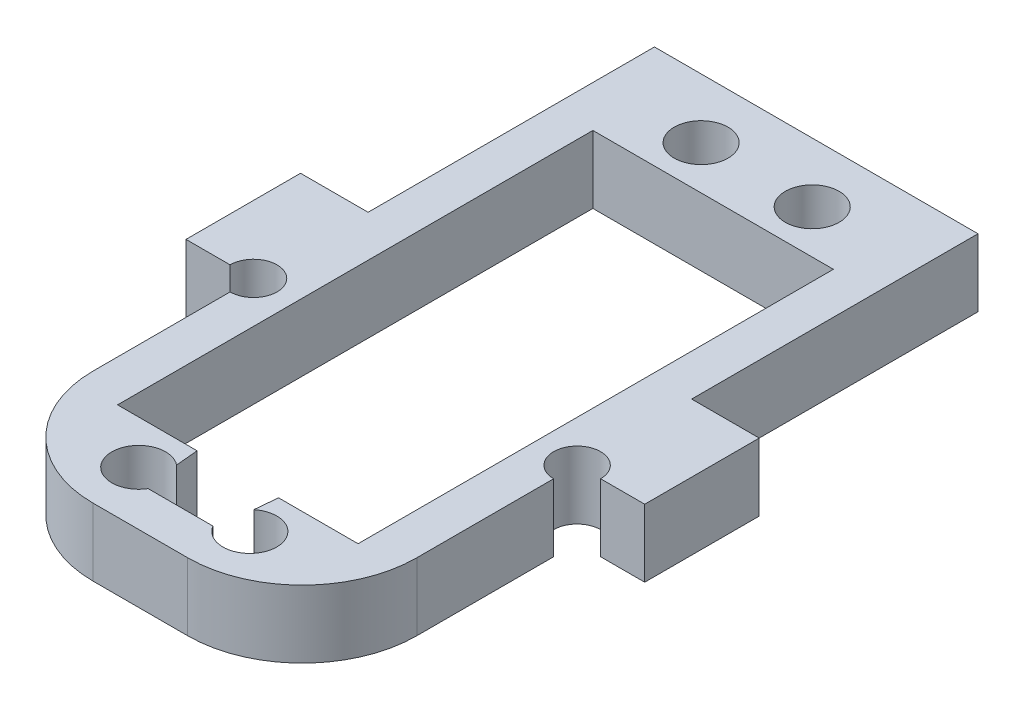
ISO-10303-21;
HEADER;
FILE_DESCRIPTION(('STEP AP214'),'2;1');
FILE_NAME('part.step','',(''),(''),'','','');
FILE_SCHEMA(('AUTOMOTIVE_DESIGN { 1 0 10303 214 1 1 1 1 }'));
ENDSEC;
DATA;
#1=APPLICATION_CONTEXT('core data for automotive mechanical design processes');
#2=APPLICATION_PROTOCOL_DEFINITION('international standard','automotive_design',2000,#1);
#3=PRODUCT_CONTEXT('',#1,'mechanical');
#4=PRODUCT('Part','Part','',(#3));
#5=PRODUCT_RELATED_PRODUCT_CATEGORY('part','',(#4));
#6=PRODUCT_DEFINITION_FORMATION('','',#4);
#7=PRODUCT_DEFINITION_CONTEXT('part definition',#1,'design');
#8=PRODUCT_DEFINITION('design','',#6,#7);
#9=PRODUCT_DEFINITION_SHAPE('','',#8);
#10=(LENGTH_UNIT() NAMED_UNIT(*) SI_UNIT(.MILLI.,.METRE.));
#11=(NAMED_UNIT(*) PLANE_ANGLE_UNIT() SI_UNIT($,.RADIAN.));
#12=(NAMED_UNIT(*) SI_UNIT($,.STERADIAN.) SOLID_ANGLE_UNIT());
#13=UNCERTAINTY_MEASURE_WITH_UNIT(LENGTH_MEASURE(1.E-05),#10,'distance_accuracy_value','');
#14=(GEOMETRIC_REPRESENTATION_CONTEXT(3) GLOBAL_UNCERTAINTY_ASSIGNED_CONTEXT((#13)) GLOBAL_UNIT_ASSIGNED_CONTEXT((#10,
#11,#12)) REPRESENTATION_CONTEXT('',''));
#15=CARTESIAN_POINT('',(0.,0.,0.));
#16=DIRECTION('',(0.,0.,1.));
#17=DIRECTION('',(1.,0.,0.));
#18=AXIS2_PLACEMENT_3D('',#15,#16,#17);
#19=CARTESIAN_POINT('',(14.1249999999984,5.89999999999827,27.9999999999989));
#20=DIRECTION('',(-0.999999999999975,0.,0.));
#21=DIRECTION('',(0.,0.,0.999999999999964));
#22=AXIS2_PLACEMENT_3D('',#19,#20,#21);
#23=PLANE('',#22);
#24=DIRECTION('',(0.,0.99999999999999,0.));
#25=VECTOR('',#24,1.);
#26=CARTESIAN_POINT('',(14.1249999999982,-11.6107708615777,-4.99999999999945));
#27=LINE('',#26,#25);
#28=CARTESIAN_POINT('',(14.1249999999985,0.,-4.99999999999894));
#29=VERTEX_POINT('',#28);
#30=CARTESIAN_POINT('',(14.1249999999985,5.8999999999978,-4.99999999999981));
#31=VERTEX_POINT('',#30);
#32=EDGE_CURVE('E252',#29,#31,#27,.T.);
#33=ORIENTED_EDGE('',*,*,#32,.F.);
#34=DIRECTION('',(0.,0.,-0.999999999999964));
#35=VECTOR('',#34,1.);
#36=CARTESIAN_POINT('',(14.1249999999984,0.,28.));
#37=LINE('',#36,#35);
#38=CARTESIAN_POINT('',(14.1249999999985,-2.16493489801906E-12,-29.9999999999992));
#39=VERTEX_POINT('',#38);
#40=EDGE_CURVE('E310',#29,#39,#37,.T.);
#41=ORIENTED_EDGE('',*,*,#40,.T.);
#42=DIRECTION('',(0.,-0.99999999999999,0.));
#43=VECTOR('',#42,1.);
#44=CARTESIAN_POINT('',(14.1249999999985,5.89999999999752,-29.999999999999));
#45=LINE('',#44,#43);
#46=CARTESIAN_POINT('',(14.1249999999985,5.89999999999752,-29.999999999999));
#47=VERTEX_POINT('',#46);
#48=EDGE_CURVE('E351',#47,#39,#45,.T.);
#49=ORIENTED_EDGE('',*,*,#48,.F.);
#50=DIRECTION('',(0.,0.,-0.999999999999964));
#51=VECTOR('',#50,1.);
#52=CARTESIAN_POINT('',(14.1249999999984,5.89999999999827,27.9999999999989));
#53=LINE('',#52,#51);
#54=EDGE_CURVE('E334',#31,#47,#53,.T.);
#55=ORIENTED_EDGE('',*,*,#54,.F.);
#56=EDGE_LOOP('',(#33,#41,#49,#55));
#57=FACE_BOUND('',#56,.T.);
#58=ADVANCED_FACE('F36',(#57),#23,.F.);
#59=CARTESIAN_POINT('',(-14.1250000000017,5.89999999999727,27.9999999999992));
#60=DIRECTION('',(0.999999999999975,0.,0.));
#61=DIRECTION('',(0.,0.,-0.999999999999964));
#62=AXIS2_PLACEMENT_3D('',#59,#60,#61);
#63=PLANE('',#62);
#64=DIRECTION('',(0.,0.,0.999999999999964));
#65=VECTOR('',#64,1.);
#66=CARTESIAN_POINT('',(-14.1250000000015,-1.02695629777827E-12,27.9999999999998));
#67=LINE('',#66,#65);
#68=CARTESIAN_POINT('',(-14.1250000000017,0.,7.04999999999949));
#69=VERTEX_POINT('',#68);
#70=CARTESIAN_POINT('',(-14.1250000000002,0.,18.9999999999995));
#71=VERTEX_POINT('',#70);
#72=EDGE_CURVE('E345',#69,#71,#67,.T.);
#73=ORIENTED_EDGE('',*,*,#72,.T.);
#74=DIRECTION('',(0.,-0.99999999999999,0.));
#75=VECTOR('',#74,1.);
#76=CARTESIAN_POINT('',(-14.1250000000003,5.89999999999896,18.9999999999998));
#77=LINE('',#76,#75);
#78=CARTESIAN_POINT('',(-14.1250000000003,5.89999999999896,18.9999999999998));
#79=VERTEX_POINT('',#78);
#80=EDGE_CURVE('E11',#71,#79,#77,.F.);
#81=ORIENTED_EDGE('',*,*,#80,.T.);
#82=DIRECTION('',(0.,0.,0.999999999999964));
#83=VECTOR('',#82,1.);
#84=CARTESIAN_POINT('',(-14.1250000000017,5.89999999999727,27.9999999999992));
#85=LINE('',#84,#83);
#86=CARTESIAN_POINT('',(-14.125,5.89999999999716,7.05000000000063));
#87=VERTEX_POINT('',#86);
#88=EDGE_CURVE('E336',#87,#79,#85,.T.);
#89=ORIENTED_EDGE('',*,*,#88,.F.);
#90=DIRECTION('',(0.,0.99999999999999,0.));
#91=VECTOR('',#90,1.);
#92=CARTESIAN_POINT('',(-14.1250000000017,-0.00100000000102796,7.04999999999989));
#93=LINE('',#92,#91);
#94=EDGE_CURVE('E245',#69,#87,#93,.T.);
#95=ORIENTED_EDGE('',*,*,#94,.F.);
#96=EDGE_LOOP('',(#73,#81,#89,#95));
#97=FACE_BOUND('',#96,.T.);
#98=ADVANCED_FACE('F444',(#97),#63,.F.);
#99=CARTESIAN_POINT('',(14.1249999999985,5.89999999999896,18.9999999999998));
#100=VERTEX_POINT('',#99);
#101=CARTESIAN_POINT('',(14.1249999999982,5.89999999999882,7.04999999999996));
#102=VERTEX_POINT('',#101);
#103=EDGE_CURVE('E331',#100,#102,#53,.T.);
#104=ORIENTED_EDGE('',*,*,#103,.F.);
#105=DIRECTION('',(0.,0.99999999999999,0.));
#106=VECTOR('',#105,1.);
#107=CARTESIAN_POINT('',(14.1249999999982,-7.49400541621981E-13,18.9999999999987));
#108=LINE('',#107,#106);
#109=CARTESIAN_POINT('',(14.1249999999982,-7.49400541621981E-13,18.9999999999987));
#110=VERTEX_POINT('',#109);
#111=EDGE_CURVE('E371',#100,#110,#108,.F.);
#112=ORIENTED_EDGE('',*,*,#111,.T.);
#113=CARTESIAN_POINT('',(14.1249999999984,-2.16493489801906E-12,7.04999999999983));
#114=VERTEX_POINT('',#113);
#115=EDGE_CURVE('E341',#110,#114,#37,.T.);
#116=ORIENTED_EDGE('',*,*,#115,.T.);
#117=DIRECTION('',(0.,0.99999999999999,0.));
#118=VECTOR('',#117,1.);
#119=CARTESIAN_POINT('',(14.1249999999984,-0.00100000000133327,7.04999999999986));
#120=LINE('',#119,#118);
#121=EDGE_CURVE('E256',#102,#114,#120,.F.);
#122=ORIENTED_EDGE('',*,*,#121,.F.);
#123=EDGE_LOOP('',(#104,#112,#116,#122));
#124=FACE_BOUND('',#123,.T.);
#125=ADVANCED_FACE('F396',(#124),#23,.F.);
#126=CARTESIAN_POINT('',(-14.125,5.89999999999705,-29.999999999999));
#127=DIRECTION('',(0.,0.,0.999999999999964));
#128=DIRECTION('',(0.999999999999975,0.,0.));
#129=AXIS2_PLACEMENT_3D('',#126,#127,#128);
#130=PLANE('',#129);
#131=DIRECTION('',(-0.999999999999975,0.,0.));
#132=VECTOR('',#131,1.);
#133=CARTESIAN_POINT('',(-14.1250000000002,-2.05391259555654E-12,-29.999999999999));
#134=LINE('',#133,#132);
#135=CARTESIAN_POINT('',(-14.1250000000002,-2.05391259555654E-12,-29.999999999999));
#136=VERTEX_POINT('',#135);
#137=EDGE_CURVE('E343',#39,#136,#134,.T.);
#138=ORIENTED_EDGE('',*,*,#137,.T.);
#139=DIRECTION('',(0.,-0.99999999999999,0.));
#140=VECTOR('',#139,1.);
#141=CARTESIAN_POINT('',(-14.125,5.89999999999705,-29.999999999999));
#142=LINE('',#141,#140);
#143=CARTESIAN_POINT('',(-14.125,5.89999999999705,-29.999999999999));
#144=VERTEX_POINT('',#143);
#145=EDGE_CURVE('E340',#144,#136,#142,.T.);
#146=ORIENTED_EDGE('',*,*,#145,.F.);
#147=DIRECTION('',(-0.999999999999975,0.,0.));
#148=VECTOR('',#147,1.);
#149=CARTESIAN_POINT('',(-14.125,5.89999999999705,-29.999999999999));
#150=LINE('',#149,#148);
#151=EDGE_CURVE('E333',#47,#144,#150,.T.);
#152=ORIENTED_EDGE('',*,*,#151,.F.);
#153=ORIENTED_EDGE('',*,*,#48,.T.);
#154=EDGE_LOOP('',(#138,#146,#152,#153));
#155=FACE_BOUND('',#154,.T.);
#156=ADVANCED_FACE('F421',(#155),#130,.F.);
#157=CARTESIAN_POINT('',(-14.1250000000015,0.,-4.99999999999994));
#158=VERTEX_POINT('',#157);
#159=EDGE_CURVE('E346',#136,#158,#67,.T.);
#160=ORIENTED_EDGE('',*,*,#159,.T.);
#161=DIRECTION('',(0.,0.99999999999999,0.));
#162=VECTOR('',#161,1.);
#163=CARTESIAN_POINT('',(-14.1250000000018,-11.6107708615767,-4.99999999999905));
#164=LINE('',#163,#162);
#165=CARTESIAN_POINT('',(-14.1250000000002,5.89999999999793,-4.9999999999996));
#166=VERTEX_POINT('',#165);
#167=EDGE_CURVE('E294',#158,#166,#164,.T.);
#168=ORIENTED_EDGE('',*,*,#167,.T.);
#169=EDGE_CURVE('E337',#144,#166,#85,.T.);
#170=ORIENTED_EDGE('',*,*,#169,.F.);
#171=ORIENTED_EDGE('',*,*,#145,.T.);
#172=EDGE_LOOP('',(#160,#168,#170,#171));
#173=FACE_BOUND('',#172,.T.);
#174=ADVANCED_FACE('F424',(#173),#63,.F.);
#175=CARTESIAN_POINT('',(-1.5404344466674E-12,5.89999999999899,-3.33066907387547E-13));
#176=DIRECTION('',(0.,-0.99999999999999,0.));
#177=DIRECTION('',(0.,0.,-0.999999999999964));
#178=AXIS2_PLACEMENT_3D('',#175,#176,#177);
#179=PLANE('',#178);
#180=DIRECTION('',(0.,0.,-0.999999999999964));
#181=VECTOR('',#180,1.);
#182=CARTESIAN_POINT('',(10.4999999999982,5.89999999999796,20.4999999999979));
#183=LINE('',#182,#181);
#184=CARTESIAN_POINT('',(10.4999999999982,5.89999999999796,20.4999999999979));
#185=VERTEX_POINT('',#184);
#186=CARTESIAN_POINT('',(10.4999999999982,5.89999999999496,-20.9999999999992));
#187=VERTEX_POINT('',#186);
#188=EDGE_CURVE('E482',#185,#187,#183,.T.);
#189=ORIENTED_EDGE('',*,*,#188,.F.);
#190=DIRECTION('',(0.999999999999975,0.,0.));
#191=VECTOR('',#190,1.);
#192=CARTESIAN_POINT('',(-10.5000000000018,5.89999999999791,20.4999999999998));
#193=LINE('',#192,#191);
#194=CARTESIAN_POINT('',(3.55454545454366,5.89999999999932,20.4999999999981));
#195=VERTEX_POINT('',#194);
#196=EDGE_CURVE('E479',#195,#185,#193,.T.);
#197=ORIENTED_EDGE('',*,*,#196,.F.);
#198=DIRECTION('',(0.0905357460425185,0.,-0.99589320646767));
#199=VECTOR('',#198,1.);
#200=CARTESIAN_POINT('',(3.59999999999847,5.89999999999793,19.9999999999999));
#201=LINE('',#200,#199);
#202=CARTESIAN_POINT('',(3.3754362039405,5.89999999999899,22.4702017566538));
#203=VERTEX_POINT('',#202);
#204=EDGE_CURVE('E454',#203,#195,#201,.T.);
#205=ORIENTED_EDGE('',*,*,#204,.F.);
#206=CARTESIAN_POINT('',(4.84999999999847,5.89999999999691,24.2999999999992));
#207=DIRECTION('',(0.,0.99999999999999,0.));
#208=DIRECTION('',(0.,0.,-0.999999999999964));
#209=AXIS2_PLACEMENT_3D('',#206,#207,#208);
#210=CIRCLE('',#209,2.35);
#211=CARTESIAN_POINT('',(2.82948026488232,5.89999999999832,25.4999999999981));
#212=VERTEX_POINT('',#211);
#213=EDGE_CURVE('E307',#212,#203,#210,.T.);
#214=ORIENTED_EDGE('',*,*,#213,.F.);
#215=DIRECTION('',(0.999999999999975,0.,0.));
#216=VECTOR('',#215,1.);
#217=CARTESIAN_POINT('',(-3.10000000000013,5.89999999999841,25.4999999999996));
#218=LINE('',#217,#216);
#219=CARTESIAN_POINT('',(-2.82948026488244,5.89999999999793,25.4999999999999));
#220=VERTEX_POINT('',#219);
#221=EDGE_CURVE('E449',#220,#212,#218,.T.);
#222=ORIENTED_EDGE('',*,*,#221,.F.);
#223=CARTESIAN_POINT('',(-4.85000000000167,5.89999999999718,24.2999999999987));
#224=DIRECTION('',(0.,0.99999999999999,0.));
#225=DIRECTION('',(0.,0.,0.999999999999964));
#226=AXIS2_PLACEMENT_3D('',#223,#224,#225);
#227=CIRCLE('',#226,2.35);
#228=CARTESIAN_POINT('',(-3.37543620394062,5.89999999999896,22.470201756654));
#229=VERTEX_POINT('',#228);
#230=EDGE_CURVE('E311',#229,#220,#227,.T.);
#231=ORIENTED_EDGE('',*,*,#230,.F.);
#232=DIRECTION('',(0.0905357460425095,0.,0.995893206467665));
#233=VECTOR('',#232,1.);
#234=CARTESIAN_POINT('',(-3.60000000000164,5.89999999999388,20.));
#235=LINE('',#234,#233);
#236=CARTESIAN_POINT('',(-3.5545454545471,5.89999999999627,20.4999999999991));
#237=VERTEX_POINT('',#236);
#238=EDGE_CURVE('E447',#237,#229,#235,.T.);
#239=ORIENTED_EDGE('',*,*,#238,.F.);
#240=CARTESIAN_POINT('',(-10.5000000000018,5.89999999999791,20.4999999999998));
#241=VERTEX_POINT('',#240);
#242=EDGE_CURVE('E51',#241,#237,#193,.T.);
#243=ORIENTED_EDGE('',*,*,#242,.F.);
#244=DIRECTION('',(0.,0.,0.999999999999964));
#245=VECTOR('',#244,1.);
#246=CARTESIAN_POINT('',(-10.5000000000018,5.89999999999791,20.4999999999998));
#247=LINE('',#246,#245);
#248=CARTESIAN_POINT('',(-10.5000000000018,5.89999999999558,-20.9999999999992));
#249=VERTEX_POINT('',#248);
#250=EDGE_CURVE('E485',#249,#241,#247,.T.);
#251=ORIENTED_EDGE('',*,*,#250,.F.);
#252=DIRECTION('',(-0.999999999999975,0.,0.));
#253=VECTOR('',#252,1.);
#254=CARTESIAN_POINT('',(-10.5000000000018,5.89999999999558,-20.9999999999992));
#255=LINE('',#254,#253);
#256=EDGE_CURVE('E489',#187,#249,#255,.T.);
#257=ORIENTED_EDGE('',*,*,#256,.F.);
#258=EDGE_LOOP('',(#189,#197,#205,#214,#222,#231,#239,#243,#251,#257));
#259=FACE_BOUND('',#258,.T.);
#260=CARTESIAN_POINT('',(4.84999999999847,5.89999999999646,-24.7999999999993));
#261=DIRECTION('',(0.,0.99999999999999,0.));
#262=DIRECTION('',(0.,0.,0.999999999999964));
#263=AXIS2_PLACEMENT_3D('',#260,#261,#262);
#264=CIRCLE('',#263,2.35);
#265=CARTESIAN_POINT('',(4.84999999999846,5.89999999999648,-22.4499999999994));
#266=VERTEX_POINT('',#265);
#267=EDGE_CURVE('E323',#266,#266,#264,.T.);
#268=ORIENTED_EDGE('',*,*,#267,.F.);
#269=EDGE_LOOP('',(#268));
#270=FACE_BOUND('',#269,.T.);
#271=CARTESIAN_POINT('',(-4.85000000000155,5.89999999999688,-24.7999999999999));
#272=DIRECTION('',(0.,0.99999999999999,0.));
#273=DIRECTION('',(0.,0.,-0.999999999999964));
#274=AXIS2_PLACEMENT_3D('',#271,#272,#273);
#275=CIRCLE('',#274,2.35);
#276=CARTESIAN_POINT('',(-4.85000000000154,5.89999999999686,-27.1499999999998));
#277=VERTEX_POINT('',#276);
#278=EDGE_CURVE('E317',#277,#277,#275,.T.);
#279=ORIENTED_EDGE('',*,*,#278,.F.);
#280=EDGE_LOOP('',(#279));
#281=FACE_BOUND('',#280,.T.);
#282=DIRECTION('',(-0.999999999999975,0.,0.));
#283=VECTOR('',#282,1.);
#284=CARTESIAN_POINT('',(14.1249999999982,5.89999999999946,28.9999999999986));
#285=LINE('',#284,#283);
#286=CARTESIAN_POINT('',(4.1249999999982,5.89999999999768,28.9999999999984));
#287=VERTEX_POINT('',#286);
#288=CARTESIAN_POINT('',(-4.12500000000154,5.89999999999696,28.9999999999984));
#289=VERTEX_POINT('',#288);
#290=EDGE_CURVE('E386',#287,#289,#285,.T.);
#291=ORIENTED_EDGE('',*,*,#290,.F.);
#292=CARTESIAN_POINT('',(4.12499999999846,5.89999999999696,18.9999999999993));
#293=DIRECTION('',(0.,-0.99999999999999,0.));
#294=DIRECTION('',(0.,0.,-0.999999999999964));
#295=AXIS2_PLACEMENT_3D('',#292,#293,#294);
#296=CIRCLE('',#295,10.);
#297=EDGE_CURVE('E369',#287,#100,#296,.F.);
#298=ORIENTED_EDGE('',*,*,#297,.T.);
#299=ORIENTED_EDGE('',*,*,#103,.T.);
#300=CARTESIAN_POINT('',(14.125,5.90000000000071,5.00000000000007));
#301=DIRECTION('',(0.,0.99999999999999,0.));
#302=DIRECTION('',(0.,0.,0.999999999999964));
#303=AXIS2_PLACEMENT_3D('',#300,#301,#302);
#304=CIRCLE('',#303,2.05);
#305=CARTESIAN_POINT('',(16.175,5.89999999999793,4.99999999999963));
#306=VERTEX_POINT('',#305);
#307=EDGE_CURVE('E236',#306,#102,#304,.T.);
#308=ORIENTED_EDGE('',*,*,#307,.F.);
#309=DIRECTION('',(0.999999999999975,0.,0.));
#310=VECTOR('',#309,1.);
#311=CARTESIAN_POINT('',(14.125,5.90000000000071,5.00000000000007));
#312=LINE('',#311,#310);
#313=CARTESIAN_POINT('',(20.0249999999977,5.89999999999793,4.9999999999995));
#314=VERTEX_POINT('',#313);
#315=EDGE_CURVE('E275',#306,#314,#312,.T.);
#316=ORIENTED_EDGE('',*,*,#315,.T.);
#317=DIRECTION('',(0.,0.,-0.999999999999964));
#318=VECTOR('',#317,1.);
#319=CARTESIAN_POINT('',(20.0249999999977,5.89999999999988,-5.00000000000111));
#320=LINE('',#319,#318);
#321=CARTESIAN_POINT('',(20.0249999999977,5.89999999999988,-5.00000000000111));
#322=VERTEX_POINT('',#321);
#323=EDGE_CURVE('E278',#314,#322,#320,.T.);
#324=ORIENTED_EDGE('',*,*,#323,.T.);
#325=DIRECTION('',(-0.999999999999975,0.,0.));
#326=VECTOR('',#325,1.);
#327=CARTESIAN_POINT('',(14.1249999999985,5.8999999999978,-4.99999999999981));
#328=LINE('',#327,#326);
#329=EDGE_CURVE('E274',#322,#31,#328,.T.);
#330=ORIENTED_EDGE('',*,*,#329,.T.);
#331=ORIENTED_EDGE('',*,*,#54,.T.);
#332=ORIENTED_EDGE('',*,*,#151,.T.);
#333=ORIENTED_EDGE('',*,*,#169,.T.);
#334=DIRECTION('',(-0.999999999999975,0.,0.));
#335=VECTOR('',#334,1.);
#336=CARTESIAN_POINT('',(-14.1250000000002,5.89999999999793,-4.9999999999996));
#337=LINE('',#336,#335);
#338=CARTESIAN_POINT('',(-20.025,5.89999999999999,-5.00000000000039));
#339=VERTEX_POINT('',#338);
#340=EDGE_CURVE('E283',#166,#339,#337,.T.);
#341=ORIENTED_EDGE('',*,*,#340,.T.);
#342=DIRECTION('',(0.,0.,0.999999999999964));
#343=VECTOR('',#342,1.);
#344=CARTESIAN_POINT('',(-20.025,5.89999999999999,-5.00000000000039));
#345=LINE('',#344,#343);
#346=CARTESIAN_POINT('',(-20.0250000000001,5.89999999999793,4.9999999999998));
#347=VERTEX_POINT('',#346);
#348=EDGE_CURVE('E277',#339,#347,#345,.T.);
#349=ORIENTED_EDGE('',*,*,#348,.T.);
#350=DIRECTION('',(0.999999999999975,0.,0.));
#351=VECTOR('',#350,1.);
#352=CARTESIAN_POINT('',(-14.1250000000001,5.89999999999874,5.00000000000089));
#353=LINE('',#352,#351);
#354=CARTESIAN_POINT('',(-16.1750000000001,5.89999999999782,4.99999999999978));
#355=VERTEX_POINT('',#354);
#356=EDGE_CURVE('E287',#347,#355,#353,.T.);
#357=ORIENTED_EDGE('',*,*,#356,.T.);
#358=CARTESIAN_POINT('',(-14.1250000000001,5.89999999999874,5.00000000000089));
#359=DIRECTION('',(0.,0.99999999999999,0.));
#360=DIRECTION('',(0.,0.,0.999999999999964));
#361=AXIS2_PLACEMENT_3D('',#358,#359,#360);
#362=CIRCLE('',#361,2.05);
#363=EDGE_CURVE('E248',#87,#355,#362,.T.);
#364=ORIENTED_EDGE('',*,*,#363,.F.);
#365=ORIENTED_EDGE('',*,*,#88,.T.);
#366=CARTESIAN_POINT('',(-4.12500000000017,5.89999999999596,18.9999999999993));
#367=DIRECTION('',(0.,-0.99999999999999,0.));
#368=DIRECTION('',(0.,0.,-0.999999999999964));
#369=AXIS2_PLACEMENT_3D('',#366,#367,#368);
#370=CIRCLE('',#369,10.);
#371=EDGE_CURVE('E367',#79,#289,#370,.F.);
#372=ORIENTED_EDGE('',*,*,#371,.T.);
#373=EDGE_LOOP('',(#291,#298,#299,#308,#316,#324,#330,#331,#332,#333,#341,#349,#357,#364,#365,#372));
#374=FACE_BOUND('',#373,.T.);
#375=ADVANCED_FACE('F392',(#259,#270,#281,#374),#179,.F.);
#376=CARTESIAN_POINT('',(0.,0.,0.));
#377=DIRECTION('',(0.,-0.99999999999999,0.));
#378=DIRECTION('',(0.,0.,-0.999999999999964));
#379=AXIS2_PLACEMENT_3D('',#376,#377,#378);
#380=PLANE('',#379);
#381=DIRECTION('',(0.999999999999975,0.,0.));
#382=VECTOR('',#381,1.);
#383=CARTESIAN_POINT('',(-10.5000000000017,-3.13638004456607E-12,20.4999999999999));
#384=LINE('',#383,#382);
#385=CARTESIAN_POINT('',(3.55454545454391,-2.74780198594726E-12,20.4999999999991));
#386=VERTEX_POINT('',#385);
#387=CARTESIAN_POINT('',(10.4999999999985,-3.13638004456607E-12,20.4999999999986));
#388=VERTEX_POINT('',#387);
#389=EDGE_CURVE('E228',#386,#388,#384,.T.);
#390=ORIENTED_EDGE('',*,*,#389,.T.);
#391=DIRECTION('',(0.,0.,-0.999999999999964));
#392=VECTOR('',#391,1.);
#393=CARTESIAN_POINT('',(10.4999999999985,-3.13638004456607E-12,20.4999999999986));
#394=LINE('',#393,#392);
#395=CARTESIAN_POINT('',(10.4999999999985,-3.1641356201817E-12,-20.9999999999992));
#396=VERTEX_POINT('',#395);
#397=EDGE_CURVE('E226',#388,#396,#394,.T.);
#398=ORIENTED_EDGE('',*,*,#397,.T.);
#399=DIRECTION('',(-0.999999999999975,0.,0.));
#400=VECTOR('',#399,1.);
#401=CARTESIAN_POINT('',(-10.5000000000017,-3.08086889333481E-12,-20.9999999999993));
#402=LINE('',#401,#400);
#403=CARTESIAN_POINT('',(-10.5000000000017,-3.08086889333481E-12,-20.9999999999993));
#404=VERTEX_POINT('',#403);
#405=EDGE_CURVE('E387',#396,#404,#402,.T.);
#406=ORIENTED_EDGE('',*,*,#405,.T.);
#407=DIRECTION('',(0.,0.,0.999999999999964));
#408=VECTOR('',#407,1.);
#409=CARTESIAN_POINT('',(-10.5000000000017,-3.13638004456607E-12,20.4999999999999));
#410=LINE('',#409,#408);
#411=CARTESIAN_POINT('',(-10.5000000000017,-3.13638004456607E-12,20.4999999999999));
#412=VERTEX_POINT('',#411);
#413=EDGE_CURVE('E225',#404,#412,#410,.T.);
#414=ORIENTED_EDGE('',*,*,#413,.T.);
#415=CARTESIAN_POINT('',(-3.5545454545471,-4.10782519111308E-12,20.4999999999998));
#416=VERTEX_POINT('',#415);
#417=EDGE_CURVE('E209',#412,#416,#384,.T.);
#418=ORIENTED_EDGE('',*,*,#417,.T.);
#419=DIRECTION('',(-0.0905357460425095,0.,-0.995893206467665));
#420=VECTOR('',#419,1.);
#421=CARTESIAN_POINT('',(-5.37377049180321,-1.02695629777827E-12,0.488524590163297));
#422=LINE('',#421,#420);
#423=CARTESIAN_POINT('',(-3.37543620394064,-1.22124532708767E-12,22.4702017566531));
#424=VERTEX_POINT('',#423);
#425=EDGE_CURVE('E222',#424,#416,#422,.T.);
#426=ORIENTED_EDGE('',*,*,#425,.F.);
#427=CARTESIAN_POINT('',(-4.85000000000167,-2.08166817117217E-12,24.2999999999974));
#428=DIRECTION('',(0.,-0.99999999999999,0.));
#429=DIRECTION('',(0.,0.,-0.999999999999964));
#430=AXIS2_PLACEMENT_3D('',#427,#428,#429);
#431=CIRCLE('',#430,2.35);
#432=CARTESIAN_POINT('',(-2.82948026488232,-2.27595720048157E-12,25.4999999999982));
#433=VERTEX_POINT('',#432);
#434=EDGE_CURVE('E308',#424,#433,#431,.F.);
#435=ORIENTED_EDGE('',*,*,#434,.T.);
#436=DIRECTION('',(-0.999999999999975,0.,0.));
#437=VECTOR('',#436,1.);
#438=CARTESIAN_POINT('',(0.,-2.22044604925031E-12,25.4999999999976));
#439=LINE('',#438,#437);
#440=CARTESIAN_POINT('',(2.82948026488232,-1.83186799063151E-12,25.4999999999974));
#441=VERTEX_POINT('',#440);
#442=EDGE_CURVE('E457',#441,#433,#439,.T.);
#443=ORIENTED_EDGE('',*,*,#442,.F.);
#444=CARTESIAN_POINT('',(4.8499999999982,-2.77555756156289E-12,24.2999999999981));
#445=DIRECTION('',(0.,-0.99999999999999,0.));
#446=DIRECTION('',(0.,0.,-0.999999999999964));
#447=AXIS2_PLACEMENT_3D('',#444,#445,#446);
#448=CIRCLE('',#447,2.35);
#449=CARTESIAN_POINT('',(3.37543620393897,-2.08166817117217E-12,22.4702017566521));
#450=VERTEX_POINT('',#449);
#451=EDGE_CURVE('E326',#441,#450,#448,.F.);
#452=ORIENTED_EDGE('',*,*,#451,.T.);
#453=DIRECTION('',(-0.0905357460425185,0.,0.99589320646767));
#454=VECTOR('',#453,1.);
#455=CARTESIAN_POINT('',(5.37377049180328,-1.08246744900953E-12,0.488524590163603));
#456=LINE('',#455,#454);
#457=EDGE_CURVE('E233',#386,#450,#456,.T.);
#458=ORIENTED_EDGE('',*,*,#457,.F.);
#459=EDGE_LOOP('',(#390,#398,#406,#414,#418,#426,#435,#443,#452,#458));
#460=FACE_BOUND('',#459,.T.);
#461=ORIENTED_EDGE('',*,*,#115,.F.);
#462=CARTESIAN_POINT('',(4.1249999999982,-2.99760216648792E-12,18.9999999999981));
#463=DIRECTION('',(0.,-0.99999999999999,0.));
#464=DIRECTION('',(0.,0.,-0.999999999999964));
#465=AXIS2_PLACEMENT_3D('',#462,#463,#464);
#466=CIRCLE('',#465,10.);
#467=CARTESIAN_POINT('',(4.12499999999999,-2.08166817117217E-12,28.9999999999992));
#468=VERTEX_POINT('',#467);
#469=EDGE_CURVE('E44',#110,#468,#466,.T.);
#470=ORIENTED_EDGE('',*,*,#469,.T.);
#471=DIRECTION('',(0.999999999999975,0.,0.));
#472=VECTOR('',#471,1.);
#473=CARTESIAN_POINT('',(-14.1250000000001,-2.05391259555654E-12,28.9999999999996));
#474=LINE('',#473,#472);
#475=CARTESIAN_POINT('',(-4.12500000000013,-3.7470027081099E-12,28.9999999999992));
#476=VERTEX_POINT('',#475);
#477=EDGE_CURVE('E377',#476,#468,#474,.T.);
#478=ORIENTED_EDGE('',*,*,#477,.F.);
#479=CARTESIAN_POINT('',(-4.12500000000167,-3.46944695195361E-12,18.9999999999982));
#480=DIRECTION('',(0.,-0.99999999999999,0.));
#481=DIRECTION('',(0.,0.,-0.999999999999964));
#482=AXIS2_PLACEMENT_3D('',#479,#480,#481);
#483=CIRCLE('',#482,10.);
#484=EDGE_CURVE('E59',#476,#71,#483,.T.);
#485=ORIENTED_EDGE('',*,*,#484,.T.);
#486=ORIENTED_EDGE('',*,*,#72,.F.);
#487=CARTESIAN_POINT('',(-14.125,-3.08086889333481E-12,5.00000000000002));
#488=DIRECTION('',(0.,-0.99999999999999,0.));
#489=DIRECTION('',(0.,0.,-0.999999999999964));
#490=AXIS2_PLACEMENT_3D('',#487,#488,#489);
#491=CIRCLE('',#490,2.05);
#492=CARTESIAN_POINT('',(-16.1750000000001,-4.66293670342566E-12,4.99999999999919));
#493=VERTEX_POINT('',#492);
#494=EDGE_CURVE('E250',#69,#493,#491,.F.);
#495=ORIENTED_EDGE('',*,*,#494,.T.);
#496=DIRECTION('',(0.999999999999975,0.,0.));
#497=VECTOR('',#496,1.);
#498=CARTESIAN_POINT('',(-14.125,-3.08086889333481E-12,5.00000000000002));
#499=LINE('',#498,#497);
#500=CARTESIAN_POINT('',(-20.0250000000001,-2.41473507855972E-12,4.9999999999992));
#501=VERTEX_POINT('',#500);
#502=EDGE_CURVE('E286',#501,#493,#499,.T.);
#503=ORIENTED_EDGE('',*,*,#502,.F.);
#504=DIRECTION('',(0.,0.,0.999999999999964));
#505=VECTOR('',#504,1.);
#506=CARTESIAN_POINT('',(-20.025,0.,-4.99999999999994));
#507=LINE('',#506,#505);
#508=CARTESIAN_POINT('',(-20.025,0.,-4.99999999999994));
#509=VERTEX_POINT('',#508);
#510=EDGE_CURVE('E295',#509,#501,#507,.T.);
#511=ORIENTED_EDGE('',*,*,#510,.F.);
#512=DIRECTION('',(-0.999999999999975,0.,0.));
#513=VECTOR('',#512,1.);
#514=CARTESIAN_POINT('',(-14.1250000000015,0.,-4.99999999999994));
#515=LINE('',#514,#513);
#516=EDGE_CURVE('E300',#158,#509,#515,.T.);
#517=ORIENTED_EDGE('',*,*,#516,.F.);
#518=ORIENTED_EDGE('',*,*,#159,.F.);
#519=ORIENTED_EDGE('',*,*,#137,.F.);
#520=ORIENTED_EDGE('',*,*,#40,.F.);
#521=DIRECTION('',(-0.999999999999975,0.,0.));
#522=VECTOR('',#521,1.);
#523=CARTESIAN_POINT('',(14.1249999999985,0.,-4.99999999999894));
#524=LINE('',#523,#522);
#525=CARTESIAN_POINT('',(20.0249999999985,0.,-5.0000000000005));
#526=VERTEX_POINT('',#525);
#527=EDGE_CURVE('E268',#526,#29,#524,.T.);
#528=ORIENTED_EDGE('',*,*,#527,.F.);
#529=DIRECTION('',(0.,0.,-0.999999999999964));
#530=VECTOR('',#529,1.);
#531=CARTESIAN_POINT('',(20.0249999999985,0.,-5.0000000000005));
#532=LINE('',#531,#530);
#533=CARTESIAN_POINT('',(20.0249999999974,-2.58126853225349E-12,4.99999999999887));
#534=VERTEX_POINT('',#533);
#535=EDGE_CURVE('E265',#534,#526,#532,.T.);
#536=ORIENTED_EDGE('',*,*,#535,.F.);
#537=DIRECTION('',(0.999999999999975,0.,0.));
#538=VECTOR('',#537,1.);
#539=CARTESIAN_POINT('',(14.1249999999997,-3.13638004456607E-12,4.99999999999973));
#540=LINE('',#539,#538);
#541=CARTESIAN_POINT('',(16.1749999999997,-5.19029264012261E-12,4.99999999999898));
#542=VERTEX_POINT('',#541);
#543=EDGE_CURVE('E264',#542,#534,#540,.T.);
#544=ORIENTED_EDGE('',*,*,#543,.F.);
#545=CARTESIAN_POINT('',(14.1249999999997,-3.38618022510673E-12,4.99999999999967));
#546=DIRECTION('',(0.,-0.99999999999999,0.));
#547=DIRECTION('',(0.,0.,-0.999999999999964));
#548=AXIS2_PLACEMENT_3D('',#545,#546,#547);
#549=CIRCLE('',#548,2.05);
#550=EDGE_CURVE('E232',#542,#114,#549,.F.);
#551=ORIENTED_EDGE('',*,*,#550,.T.);
#552=EDGE_LOOP('',(#461,#470,#478,#485,#486,#495,#503,#511,#517,#518,#519,#520,#528,#536,#544,#551));
#553=FACE_BOUND('',#552,.T.);
#554=CARTESIAN_POINT('',(4.85000000000001,-2.27595720048157E-12,-24.799999999999));
#555=DIRECTION('',(0.,-0.99999999999999,0.));
#556=DIRECTION('',(0.,0.,-0.999999999999964));
#557=AXIS2_PLACEMENT_3D('',#554,#555,#556);
#558=CIRCLE('',#557,2.35);
#559=CARTESIAN_POINT('',(4.85000000000002,-2.29471771445722E-12,-27.1499999999989));
#560=VERTEX_POINT('',#559);
#561=EDGE_CURVE('E320',#560,#560,#558,.F.);
#562=ORIENTED_EDGE('',*,*,#561,.T.);
#563=EDGE_LOOP('',(#562));
#564=FACE_BOUND('',#563,.T.);
#565=CARTESIAN_POINT('',(-4.85000000000013,-2.1094237467878E-12,-24.7999999999991));
#566=DIRECTION('',(0.,-0.99999999999999,0.));
#567=DIRECTION('',(0.,0.,-0.999999999999964));
#568=AXIS2_PLACEMENT_3D('',#565,#566,#567);
#569=CIRCLE('',#568,2.35);
#570=CARTESIAN_POINT('',(-4.85000000000012,-2.12818426076344E-12,-27.149999999999));
#571=VERTEX_POINT('',#570);
#572=EDGE_CURVE('E314',#571,#571,#569,.F.);
#573=ORIENTED_EDGE('',*,*,#572,.T.);
#574=EDGE_LOOP('',(#573));
#575=FACE_BOUND('',#574,.T.);
#576=ADVANCED_FACE('F220',(#460,#553,#564,#575),#380,.T.);
#577=CARTESIAN_POINT('',(-4.85000000000167,-0.00100000000283207,24.2999999999982));
#578=DIRECTION('',(0.,0.99999999999999,0.));
#579=DIRECTION('',(0.,0.,0.999999999999964));
#580=AXIS2_PLACEMENT_3D('',#577,#578,#579);
#581=CYLINDRICAL_SURFACE('',#580,2.35);
#582=ORIENTED_EDGE('',*,*,#230,.T.);
#583=DIRECTION('',(0.,0.99999999999999,0.));
#584=VECTOR('',#583,1.);
#585=CARTESIAN_POINT('',(-2.82948026488232,-0.00100000000066713,25.4999999999995));
#586=LINE('',#585,#584);
#587=EDGE_CURVE('E238',#220,#433,#586,.F.);
#588=ORIENTED_EDGE('',*,*,#587,.T.);
#589=ORIENTED_EDGE('',*,*,#434,.F.);
#590=DIRECTION('',(0.,0.99999999999999,0.));
#591=VECTOR('',#590,1.);
#592=CARTESIAN_POINT('',(-3.3754362039405,-0.00100000000202716,22.4702017566542));
#593=LINE('',#592,#591);
#594=EDGE_CURVE('E231',#424,#229,#593,.T.);
#595=ORIENTED_EDGE('',*,*,#594,.T.);
#596=EDGE_LOOP('',(#582,#588,#589,#595));
#597=FACE_BOUND('',#596,.T.);
#598=ADVANCED_FACE('F460',(#597),#581,.F.);
#599=CARTESIAN_POINT('',(-4.85000000000013,-0.00100000000241574,-24.7999999999992));
#600=DIRECTION('',(0.,0.99999999999999,0.));
#601=DIRECTION('',(0.,0.,0.999999999999964));
#602=AXIS2_PLACEMENT_3D('',#599,#600,#601);
#603=CYLINDRICAL_SURFACE('',#602,2.35);
#604=ORIENTED_EDGE('',*,*,#572,.F.);
#605=EDGE_LOOP('',(#604));
#606=FACE_BOUND('',#605,.T.);
#607=ORIENTED_EDGE('',*,*,#278,.T.);
#608=EDGE_LOOP('',(#607));
#609=FACE_BOUND('',#608,.T.);
#610=ADVANCED_FACE('F547',(#606,#609),#603,.F.);
#611=CARTESIAN_POINT('',(4.85000000000001,-0.00100000000291534,-24.7999999999988));
#612=DIRECTION('',(0.,0.99999999999999,0.));
#613=DIRECTION('',(0.,0.,0.999999999999964));
#614=AXIS2_PLACEMENT_3D('',#611,#612,#613);
#615=CYLINDRICAL_SURFACE('',#614,2.35);
#616=ORIENTED_EDGE('',*,*,#561,.F.);
#617=EDGE_LOOP('',(#616));
#618=FACE_BOUND('',#617,.T.);
#619=ORIENTED_EDGE('',*,*,#267,.T.);
#620=EDGE_LOOP('',(#619));
#621=FACE_BOUND('',#620,.T.);
#622=ADVANCED_FACE('F544',(#618,#621),#615,.F.);
#623=CARTESIAN_POINT('',(4.8499999999982,-0.00100000000330391,24.2999999999988));
#624=DIRECTION('',(0.,0.99999999999999,0.));
#625=DIRECTION('',(0.,0.,0.999999999999964));
#626=AXIS2_PLACEMENT_3D('',#623,#624,#625);
#627=CYLINDRICAL_SURFACE('',#626,2.35);
#628=ORIENTED_EDGE('',*,*,#213,.T.);
#629=DIRECTION('',(0.,0.99999999999999,0.));
#630=VECTOR('',#629,1.);
#631=CARTESIAN_POINT('',(3.37543620393897,-0.001000000002499,22.4702017566531));
#632=LINE('',#631,#630);
#633=EDGE_CURVE('E357',#203,#450,#632,.F.);
#634=ORIENTED_EDGE('',*,*,#633,.T.);
#635=ORIENTED_EDGE('',*,*,#451,.F.);
#636=DIRECTION('',(0.,0.99999999999999,0.));
#637=VECTOR('',#636,1.);
#638=CARTESIAN_POINT('',(2.82948026488232,-0.00100000000169409,25.4999999999979));
#639=LINE('',#638,#637);
#640=EDGE_CURVE('E354',#441,#212,#639,.T.);
#641=ORIENTED_EDGE('',*,*,#640,.T.);
#642=EDGE_LOOP('',(#628,#634,#635,#641));
#643=FACE_BOUND('',#642,.T.);
#644=ADVANCED_FACE('F468',(#643),#627,.F.);
#645=CARTESIAN_POINT('',(-14.125,-11.6107708615764,5.00000000000035));
#646=DIRECTION('',(0.,0.,0.999999999999964));
#647=DIRECTION('',(0.999999999999975,0.,0.));
#648=AXIS2_PLACEMENT_3D('',#645,#646,#647);
#649=PLANE('',#648);
#650=DIRECTION('',(0.,0.99999999999999,0.));
#651=VECTOR('',#650,1.);
#652=CARTESIAN_POINT('',(-16.1750000000001,-0.00100000000338718,4.99999999999971));
#653=LINE('',#652,#651);
#654=EDGE_CURVE('E242',#493,#355,#653,.T.);
#655=ORIENTED_EDGE('',*,*,#654,.T.);
#656=ORIENTED_EDGE('',*,*,#356,.F.);
#657=DIRECTION('',(0.,0.99999999999999,0.));
#658=VECTOR('',#657,1.);
#659=CARTESIAN_POINT('',(-20.0250000000003,-11.6107708615766,4.99999999999944));
#660=LINE('',#659,#658);
#661=EDGE_CURVE('E298',#501,#347,#660,.T.);
#662=ORIENTED_EDGE('',*,*,#661,.F.);
#663=ORIENTED_EDGE('',*,*,#502,.T.);
#664=EDGE_LOOP('',(#655,#656,#662,#663));
#665=FACE_BOUND('',#664,.T.);
#666=ADVANCED_FACE('F438',(#665),#649,.T.);
#667=CARTESIAN_POINT('',(-14.1250000000018,-11.6107708615767,-4.99999999999905));
#668=DIRECTION('',(0.,0.,-0.999999999999964));
#669=DIRECTION('',(-0.999999999999975,0.,0.));
#670=AXIS2_PLACEMENT_3D('',#667,#668,#669);
#671=PLANE('',#670);
#672=ORIENTED_EDGE('',*,*,#167,.F.);
#673=ORIENTED_EDGE('',*,*,#516,.T.);
#674=DIRECTION('',(0.,0.99999999999999,0.));
#675=VECTOR('',#674,1.);
#676=CARTESIAN_POINT('',(-20.025,-11.6107708615772,-4.99999999999984));
#677=LINE('',#676,#675);
#678=EDGE_CURVE('E299',#509,#339,#677,.T.);
#679=ORIENTED_EDGE('',*,*,#678,.T.);
#680=ORIENTED_EDGE('',*,*,#340,.F.);
#681=EDGE_LOOP('',(#672,#673,#679,#680));
#682=FACE_BOUND('',#681,.T.);
#683=ADVANCED_FACE('F427',(#682),#671,.T.);
#684=CARTESIAN_POINT('',(-20.025,-11.6107708615772,-4.99999999999984));
#685=DIRECTION('',(-0.999999999999975,0.,0.));
#686=DIRECTION('',(0.,0.,0.999999999999964));
#687=AXIS2_PLACEMENT_3D('',#684,#685,#686);
#688=PLANE('',#687);
#689=ORIENTED_EDGE('',*,*,#678,.F.);
#690=ORIENTED_EDGE('',*,*,#510,.T.);
#691=ORIENTED_EDGE('',*,*,#661,.T.);
#692=ORIENTED_EDGE('',*,*,#348,.F.);
#693=EDGE_LOOP('',(#689,#690,#691,#692));
#694=FACE_BOUND('',#693,.T.);
#695=ADVANCED_FACE('F431',(#694),#688,.T.);
#696=CARTESIAN_POINT('',(14.125,-11.6107708615778,4.99999999999957));
#697=DIRECTION('',(0.,0.,0.999999999999964));
#698=DIRECTION('',(0.999999999999975,0.,0.));
#699=AXIS2_PLACEMENT_3D('',#696,#697,#698);
#700=PLANE('',#699);
#701=DIRECTION('',(0.,0.99999999999999,0.));
#702=VECTOR('',#701,1.);
#703=CARTESIAN_POINT('',(16.1749999999997,-0.00100000000308187,4.99999999999959));
#704=LINE('',#703,#702);
#705=EDGE_CURVE('E246',#306,#542,#704,.F.);
#706=ORIENTED_EDGE('',*,*,#705,.T.);
#707=ORIENTED_EDGE('',*,*,#543,.T.);
#708=DIRECTION('',(0.,0.99999999999999,0.));
#709=VECTOR('',#708,1.);
#710=CARTESIAN_POINT('',(20.0249999999985,-11.6107708615771,4.99999999999874));
#711=LINE('',#710,#709);
#712=EDGE_CURVE('E261',#534,#314,#711,.T.);
#713=ORIENTED_EDGE('',*,*,#712,.T.);
#714=ORIENTED_EDGE('',*,*,#315,.F.);
#715=EDGE_LOOP('',(#706,#707,#713,#714));
#716=FACE_BOUND('',#715,.T.);
#717=ADVANCED_FACE('F403',(#716),#700,.T.);
#718=CARTESIAN_POINT('',(20.0249999999985,-11.6107708615781,-5.00000000000025));
#719=DIRECTION('',(0.999999999999975,0.,0.));
#720=DIRECTION('',(0.,0.,-0.999999999999964));
#721=AXIS2_PLACEMENT_3D('',#718,#719,#720);
#722=PLANE('',#721);
#723=ORIENTED_EDGE('',*,*,#712,.F.);
#724=ORIENTED_EDGE('',*,*,#535,.T.);
#725=DIRECTION('',(0.,0.99999999999999,0.));
#726=VECTOR('',#725,1.);
#727=CARTESIAN_POINT('',(20.0249999999985,-11.6107708615781,-5.00000000000025));
#728=LINE('',#727,#726);
#729=EDGE_CURVE('E266',#526,#322,#728,.T.);
#730=ORIENTED_EDGE('',*,*,#729,.T.);
#731=ORIENTED_EDGE('',*,*,#323,.F.);
#732=EDGE_LOOP('',(#723,#724,#730,#731));
#733=FACE_BOUND('',#732,.T.);
#734=ADVANCED_FACE('F562',(#733),#722,.T.);
#735=CARTESIAN_POINT('',(14.1249999999982,-11.6107708615777,-4.99999999999945));
#736=DIRECTION('',(0.,0.,-0.999999999999964));
#737=DIRECTION('',(-0.999999999999975,0.,0.));
#738=AXIS2_PLACEMENT_3D('',#735,#736,#737);
#739=PLANE('',#738);
#740=ORIENTED_EDGE('',*,*,#729,.F.);
#741=ORIENTED_EDGE('',*,*,#527,.T.);
#742=ORIENTED_EDGE('',*,*,#32,.T.);
#743=ORIENTED_EDGE('',*,*,#329,.F.);
#744=EDGE_LOOP('',(#740,#741,#742,#743));
#745=FACE_BOUND('',#744,.T.);
#746=ADVANCED_FACE('F411',(#745),#739,.T.);
#747=CARTESIAN_POINT('',(14.1249999999997,-0.00100000000113898,5.0000000000007));
#748=DIRECTION('',(0.,0.99999999999999,0.));
#749=DIRECTION('',(0.,0.,0.999999999999964));
#750=AXIS2_PLACEMENT_3D('',#747,#748,#749);
#751=CYLINDRICAL_SURFACE('',#750,2.05);
#752=ORIENTED_EDGE('',*,*,#121,.T.);
#753=ORIENTED_EDGE('',*,*,#550,.F.);
#754=ORIENTED_EDGE('',*,*,#705,.F.);
#755=ORIENTED_EDGE('',*,*,#307,.T.);
#756=EDGE_LOOP('',(#752,#753,#754,#755));
#757=FACE_BOUND('',#756,.T.);
#758=ADVANCED_FACE('F398',(#757),#751,.F.);
#759=CARTESIAN_POINT('',(-14.125,-0.001000000002499,5.00000000000073));
#760=DIRECTION('',(0.,0.99999999999999,0.));
#761=DIRECTION('',(0.,0.,0.999999999999964));
#762=AXIS2_PLACEMENT_3D('',#759,#760,#761);
#763=CYLINDRICAL_SURFACE('',#762,2.05);
#764=ORIENTED_EDGE('',*,*,#94,.T.);
#765=ORIENTED_EDGE('',*,*,#363,.T.);
#766=ORIENTED_EDGE('',*,*,#654,.F.);
#767=ORIENTED_EDGE('',*,*,#494,.F.);
#768=EDGE_LOOP('',(#764,#765,#766,#767));
#769=FACE_BOUND('',#768,.T.);
#770=ADVANCED_FACE('F440',(#769),#763,.F.);
#771=CARTESIAN_POINT('',(-3.10000000000001,-4.10000000000002,25.4999999999995));
#772=DIRECTION('',(0.,0.,0.999999999999964));
#773=DIRECTION('',(0.999999999999975,0.,0.));
#774=AXIS2_PLACEMENT_3D('',#771,#772,#773);
#775=PLANE('',#774);
#776=ORIENTED_EDGE('',*,*,#221,.T.);
#777=ORIENTED_EDGE('',*,*,#640,.F.);
#778=ORIENTED_EDGE('',*,*,#442,.T.);
#779=ORIENTED_EDGE('',*,*,#587,.F.);
#780=EDGE_LOOP('',(#776,#777,#778,#779));
#781=FACE_BOUND('',#780,.T.);
#782=ADVANCED_FACE('F571',(#781),#775,.F.);
#783=CARTESIAN_POINT('',(3.5999999999982,-4.10000000000069,19.999999999998));
#784=DIRECTION('',(0.995893206467679,0.,0.0905357460425128));
#785=DIRECTION('',(0.0905357460425185,0.,-0.99589320646767));
#786=AXIS2_PLACEMENT_3D('',#783,#784,#785);
#787=PLANE('',#786);
#788=ORIENTED_EDGE('',*,*,#204,.T.);
#789=DIRECTION('',(0.,0.99999999999999,0.));
#790=VECTOR('',#789,1.);
#791=CARTESIAN_POINT('',(3.55454545454391,-0.00100000000069489,20.4999999999979));
#792=LINE('',#791,#790);
#793=EDGE_CURVE('E214',#386,#195,#792,.T.);
#794=ORIENTED_EDGE('',*,*,#793,.F.);
#795=ORIENTED_EDGE('',*,*,#457,.T.);
#796=ORIENTED_EDGE('',*,*,#633,.F.);
#797=EDGE_LOOP('',(#788,#794,#795,#796));
#798=FACE_BOUND('',#797,.T.);
#799=ADVANCED_FACE('F472',(#798),#787,.F.);
#800=CARTESIAN_POINT('',(-3.60000000000152,-4.10000000000244,19.9999999999983));
#801=DIRECTION('',(-0.99589320646768,0.,0.0905357460425157));
#802=DIRECTION('',(0.0905357460425095,0.,0.995893206467665));
#803=AXIS2_PLACEMENT_3D('',#800,#801,#802);
#804=PLANE('',#803);
#805=ORIENTED_EDGE('',*,*,#425,.T.);
#806=DIRECTION('',(0.,-0.99999999999999,0.));
#807=VECTOR('',#806,1.);
#808=CARTESIAN_POINT('',(-3.5545454545471,-0.00100000000330391,20.4999999999987));
#809=LINE('',#808,#807);
#810=EDGE_CURVE('E206',#237,#416,#809,.T.);
#811=ORIENTED_EDGE('',*,*,#810,.F.);
#812=ORIENTED_EDGE('',*,*,#238,.T.);
#813=ORIENTED_EDGE('',*,*,#594,.F.);
#814=EDGE_LOOP('',(#805,#811,#812,#813));
#815=FACE_BOUND('',#814,.T.);
#816=ADVANCED_FACE('F229',(#815),#804,.F.);
#817=CARTESIAN_POINT('',(-2.63677968348475E-13,-1.58206781009085E-12,28.9999999999992));
#818=DIRECTION('',(0.,0.,0.999999999999964));
#819=DIRECTION('',(0.999999999999975,0.,0.));
#820=AXIS2_PLACEMENT_3D('',#817,#818,#819);
#821=PLANE('',#820);
#822=ORIENTED_EDGE('',*,*,#477,.T.);
#823=DIRECTION('',(0.,0.99999999999999,0.));
#824=VECTOR('',#823,1.);
#825=CARTESIAN_POINT('',(4.1249999999982,5.89999999999768,28.9999999999984));
#826=LINE('',#825,#824);
#827=EDGE_CURVE('E364',#468,#287,#826,.T.);
#828=ORIENTED_EDGE('',*,*,#827,.T.);
#829=ORIENTED_EDGE('',*,*,#290,.T.);
#830=DIRECTION('',(0.,-0.99999999999999,0.));
#831=VECTOR('',#830,1.);
#832=CARTESIAN_POINT('',(-4.12500000000013,-3.7470027081099E-12,28.9999999999992));
#833=LINE('',#832,#831);
#834=EDGE_CURVE('E361',#289,#476,#833,.T.);
#835=ORIENTED_EDGE('',*,*,#834,.T.);
#836=EDGE_LOOP('',(#822,#828,#829,#835));
#837=FACE_BOUND('',#836,.T.);
#838=ADVANCED_FACE('F382',(#837),#821,.T.);
#839=CARTESIAN_POINT('',(4.1249999999982,-2.99760216648792E-12,18.9999999999981));
#840=DIRECTION('',(0.,-0.99999999999999,0.));
#841=DIRECTION('',(0.,0.,-0.999999999999964));
#842=AXIS2_PLACEMENT_3D('',#839,#840,#841);
#843=CYLINDRICAL_SURFACE('',#842,10.);
#844=ORIENTED_EDGE('',*,*,#469,.F.);
#845=ORIENTED_EDGE('',*,*,#111,.F.);
#846=ORIENTED_EDGE('',*,*,#297,.F.);
#847=ORIENTED_EDGE('',*,*,#827,.F.);
#848=EDGE_LOOP('',(#844,#845,#846,#847));
#849=FACE_BOUND('',#848,.T.);
#850=ADVANCED_FACE('F389',(#849),#843,.T.);
#851=CARTESIAN_POINT('',(-4.12500000000167,-3.46944695195361E-12,18.9999999999982));
#852=DIRECTION('',(0.,0.99999999999999,0.));
#853=DIRECTION('',(0.,0.,0.999999999999964));
#854=AXIS2_PLACEMENT_3D('',#851,#852,#853);
#855=CYLINDRICAL_SURFACE('',#854,10.);
#856=ORIENTED_EDGE('',*,*,#371,.F.);
#857=ORIENTED_EDGE('',*,*,#80,.F.);
#858=ORIENTED_EDGE('',*,*,#484,.F.);
#859=ORIENTED_EDGE('',*,*,#834,.F.);
#860=EDGE_LOOP('',(#856,#857,#858,#859));
#861=FACE_BOUND('',#860,.T.);
#862=ADVANCED_FACE('F38',(#861),#855,.T.);
#863=CARTESIAN_POINT('',(-10.5000000000017,-0.00100000000111122,20.4999999999984));
#864=DIRECTION('',(0.,0.,0.999999999999964));
#865=DIRECTION('',(0.999999999999975,0.,0.));
#866=AXIS2_PLACEMENT_3D('',#863,#864,#865);
#867=PLANE('',#866);
#868=ORIENTED_EDGE('',*,*,#793,.T.);
#869=ORIENTED_EDGE('',*,*,#196,.T.);
#870=DIRECTION('',(0.,0.99999999999999,0.));
#871=VECTOR('',#870,1.);
#872=CARTESIAN_POINT('',(10.4999999999985,-0.00100000000252676,20.4999999999973));
#873=LINE('',#872,#871);
#874=EDGE_CURVE('E493',#388,#185,#873,.T.);
#875=ORIENTED_EDGE('',*,*,#874,.F.);
#876=ORIENTED_EDGE('',*,*,#389,.F.);
#877=EDGE_LOOP('',(#868,#869,#875,#876));
#878=FACE_BOUND('',#877,.T.);
#879=ADVANCED_FACE('F512',(#878),#867,.F.);
#880=CARTESIAN_POINT('',(10.4999999999985,-0.00100000000252676,20.4999999999973));
#881=DIRECTION('',(0.999999999999975,0.,0.));
#882=DIRECTION('',(0.,0.,-0.999999999999964));
#883=AXIS2_PLACEMENT_3D('',#880,#881,#882);
#884=PLANE('',#883);
#885=ORIENTED_EDGE('',*,*,#874,.T.);
#886=ORIENTED_EDGE('',*,*,#188,.T.);
#887=DIRECTION('',(0.,0.99999999999999,0.));
#888=VECTOR('',#887,1.);
#889=CARTESIAN_POINT('',(10.4999999999985,-0.00100000000391454,-20.9999999999995));
#890=LINE('',#889,#888);
#891=EDGE_CURVE('E487',#396,#187,#890,.T.);
#892=ORIENTED_EDGE('',*,*,#891,.F.);
#893=ORIENTED_EDGE('',*,*,#397,.F.);
#894=EDGE_LOOP('',(#885,#886,#892,#893));
#895=FACE_BOUND('',#894,.T.);
#896=ADVANCED_FACE('F506',(#895),#884,.F.);
#897=DIRECTION('',(0.,0.99999999999999,0.));
#898=VECTOR('',#897,1.);
#899=CARTESIAN_POINT('',(-10.5000000000017,-0.00100000000111122,20.4999999999984));
#900=LINE('',#899,#898);
#901=EDGE_CURVE('E495',#412,#241,#900,.T.);
#902=ORIENTED_EDGE('',*,*,#901,.T.);
#903=ORIENTED_EDGE('',*,*,#242,.T.);
#904=ORIENTED_EDGE('',*,*,#810,.T.);
#905=ORIENTED_EDGE('',*,*,#417,.F.);
#906=EDGE_LOOP('',(#902,#903,#904,#905));
#907=FACE_BOUND('',#906,.T.);
#908=ADVANCED_FACE('F208',(#907),#867,.F.);
#909=CARTESIAN_POINT('',(-10.5000000000017,-0.00100000000111122,20.4999999999984));
#910=DIRECTION('',(-0.999999999999975,0.,0.));
#911=DIRECTION('',(0.,0.,0.999999999999964));
#912=AXIS2_PLACEMENT_3D('',#909,#910,#911);
#913=PLANE('',#912);
#914=DIRECTION('',(0.,0.99999999999999,0.));
#915=VECTOR('',#914,1.);
#916=CARTESIAN_POINT('',(-10.5000000000017,-0.00100000000355371,-20.9999999999996));
#917=LINE('',#916,#915);
#918=EDGE_CURVE('E497',#404,#249,#917,.T.);
#919=ORIENTED_EDGE('',*,*,#918,.T.);
#920=ORIENTED_EDGE('',*,*,#250,.T.);
#921=ORIENTED_EDGE('',*,*,#901,.F.);
#922=ORIENTED_EDGE('',*,*,#413,.F.);
#923=EDGE_LOOP('',(#919,#920,#921,#922));
#924=FACE_BOUND('',#923,.T.);
#925=ADVANCED_FACE('F522',(#924),#913,.F.);
#926=CARTESIAN_POINT('',(-10.5000000000017,-0.00100000000355371,-20.9999999999996));
#927=DIRECTION('',(0.,0.,-0.999999999999964));
#928=DIRECTION('',(-0.999999999999975,0.,0.));
#929=AXIS2_PLACEMENT_3D('',#926,#927,#928);
#930=PLANE('',#929);
#931=ORIENTED_EDGE('',*,*,#891,.T.);
#932=ORIENTED_EDGE('',*,*,#256,.T.);
#933=ORIENTED_EDGE('',*,*,#918,.F.);
#934=ORIENTED_EDGE('',*,*,#405,.F.);
#935=EDGE_LOOP('',(#931,#932,#933,#934));
#936=FACE_BOUND('',#935,.T.);
#937=ADVANCED_FACE('F503',(#936),#930,.F.);
#938=CLOSED_SHELL('',(#58,#98,#125,#156,#174,#375,#576,#598,#610,#622,#644,#666,#683,#695,#717,
#734,#746,#758,#770,#782,#799,#816,#838,#850,#862,#879,#896,#908,#925,#937));
#939=MANIFOLD_SOLID_BREP('B2',#938);
#940=ADVANCED_BREP_SHAPE_REPRESENTATION('',(#18,#939),#14);
#941=SHAPE_DEFINITION_REPRESENTATION(#9,#940);
ENDSEC;
END-ISO-10303-21;
